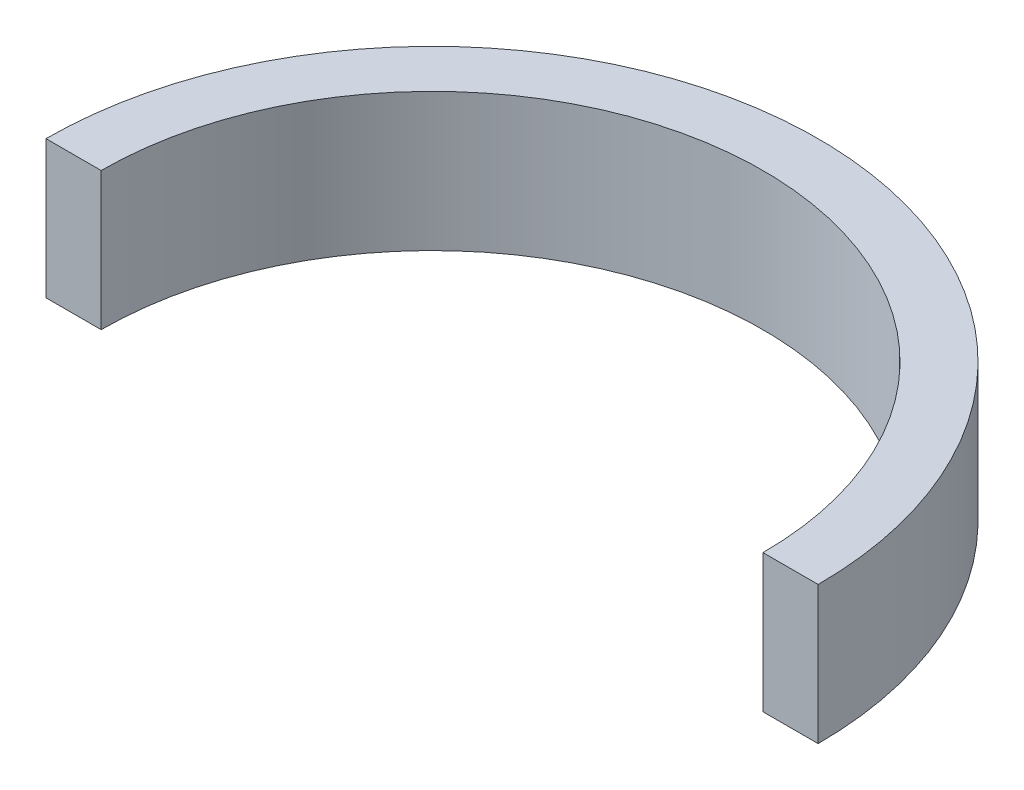
ISO-10303-21;
HEADER;
FILE_DESCRIPTION(('STEP AP214'),'2;1');
FILE_NAME('part.step','',(''),(''),'','','');
FILE_SCHEMA(('AUTOMOTIVE_DESIGN { 1 0 10303 214 1 1 1 1 }'));
ENDSEC;
DATA;
#1=APPLICATION_CONTEXT('core data for automotive mechanical design processes');
#2=APPLICATION_PROTOCOL_DEFINITION('international standard','automotive_design',2000,#1);
#3=PRODUCT_CONTEXT('',#1,'mechanical');
#4=PRODUCT('Part','Part','',(#3));
#5=PRODUCT_RELATED_PRODUCT_CATEGORY('part','',(#4));
#6=PRODUCT_DEFINITION_FORMATION('','',#4);
#7=PRODUCT_DEFINITION_CONTEXT('part definition',#1,'design');
#8=PRODUCT_DEFINITION('design','',#6,#7);
#9=PRODUCT_DEFINITION_SHAPE('','',#8);
#10=(LENGTH_UNIT() NAMED_UNIT(*) SI_UNIT(.MILLI.,.METRE.));
#11=(NAMED_UNIT(*) PLANE_ANGLE_UNIT() SI_UNIT($,.RADIAN.));
#12=(NAMED_UNIT(*) SI_UNIT($,.STERADIAN.) SOLID_ANGLE_UNIT());
#13=UNCERTAINTY_MEASURE_WITH_UNIT(LENGTH_MEASURE(1.E-05),#10,'distance_accuracy_value','');
#14=(GEOMETRIC_REPRESENTATION_CONTEXT(3) GLOBAL_UNCERTAINTY_ASSIGNED_CONTEXT((#13)) GLOBAL_UNIT_ASSIGNED_CONTEXT((#10,
#11,#12)) REPRESENTATION_CONTEXT('',''));
#15=CARTESIAN_POINT('',(0.,0.,0.));
#16=DIRECTION('',(0.,0.,1.));
#17=DIRECTION('',(1.,0.,0.));
#18=AXIS2_PLACEMENT_3D('',#15,#16,#17);
#19=CARTESIAN_POINT('',(0.,20.,0.));
#20=DIRECTION('',(0.,-1.,0.));
#21=DIRECTION('',(0.,0.,-1.));
#22=AXIS2_PLACEMENT_3D('',#19,#20,#21);
#23=CYLINDRICAL_SURFACE('',#22,56.);
#24=CARTESIAN_POINT('',(0.,0.,0.));
#25=DIRECTION('',(0.,1.,0.));
#26=DIRECTION('',(0.,0.,-1.));
#27=AXIS2_PLACEMENT_3D('',#24,#25,#26);
#28=CIRCLE('',#27,56.);
#29=CARTESIAN_POINT('',(56.,0.,0.));
#30=VERTEX_POINT('',#29);
#31=CARTESIAN_POINT('',(-56.,0.,0.));
#32=VERTEX_POINT('',#31);
#33=EDGE_CURVE('E97',#30,#32,#28,.T.);
#34=ORIENTED_EDGE('',*,*,#33,.T.);
#35=DIRECTION('',(0.,-1.,0.));
#36=VECTOR('',#35,1.);
#37=CARTESIAN_POINT('',(-56.,20.,0.));
#38=LINE('',#37,#36);
#39=CARTESIAN_POINT('',(-56.,20.,0.));
#40=VERTEX_POINT('',#39);
#41=EDGE_CURVE('E11',#40,#32,#38,.T.);
#42=ORIENTED_EDGE('',*,*,#41,.F.);
#43=CARTESIAN_POINT('',(0.,20.,0.));
#44=DIRECTION('',(0.,1.,0.));
#45=DIRECTION('',(0.,0.,-1.));
#46=AXIS2_PLACEMENT_3D('',#43,#44,#45);
#47=CIRCLE('',#46,56.);
#48=CARTESIAN_POINT('',(56.,20.,0.));
#49=VERTEX_POINT('',#48);
#50=EDGE_CURVE('E85',#49,#40,#47,.T.);
#51=ORIENTED_EDGE('',*,*,#50,.F.);
#52=DIRECTION('',(0.,-1.,0.));
#53=VECTOR('',#52,1.);
#54=CARTESIAN_POINT('',(56.,20.,0.));
#55=LINE('',#54,#53);
#56=EDGE_CURVE('E93',#49,#30,#55,.T.);
#57=ORIENTED_EDGE('',*,*,#56,.T.);
#58=EDGE_LOOP('',(#34,#42,#51,#57));
#59=FACE_BOUND('',#58,.T.);
#60=ADVANCED_FACE('F34',(#59),#23,.T.);
#61=CARTESIAN_POINT('',(-56.,20.,0.));
#62=DIRECTION('',(0.,0.,-1.));
#63=DIRECTION('',(-1.,0.,0.));
#64=AXIS2_PLACEMENT_3D('',#61,#62,#63);
#65=PLANE('',#64);
#66=DIRECTION('',(1.,0.,0.));
#67=VECTOR('',#66,1.);
#68=CARTESIAN_POINT('',(-56.,0.,0.));
#69=LINE('',#68,#67);
#70=CARTESIAN_POINT('',(-48.,0.,0.));
#71=VERTEX_POINT('',#70);
#72=EDGE_CURVE('E89',#32,#71,#69,.T.);
#73=ORIENTED_EDGE('',*,*,#72,.T.);
#74=DIRECTION('',(0.,-1.,0.));
#75=VECTOR('',#74,1.);
#76=CARTESIAN_POINT('',(-48.,20.,0.));
#77=LINE('',#76,#75);
#78=CARTESIAN_POINT('',(-48.,20.,0.));
#79=VERTEX_POINT('',#78);
#80=EDGE_CURVE('E42',#79,#71,#77,.T.);
#81=ORIENTED_EDGE('',*,*,#80,.F.);
#82=DIRECTION('',(1.,0.,0.));
#83=VECTOR('',#82,1.);
#84=CARTESIAN_POINT('',(-56.,20.,0.));
#85=LINE('',#84,#83);
#86=EDGE_CURVE('E80',#40,#79,#85,.T.);
#87=ORIENTED_EDGE('',*,*,#86,.F.);
#88=ORIENTED_EDGE('',*,*,#41,.T.);
#89=EDGE_LOOP('',(#73,#81,#87,#88));
#90=FACE_BOUND('',#89,.T.);
#91=ADVANCED_FACE('F88',(#90),#65,.F.);
#92=CARTESIAN_POINT('',(0.,20.,0.));
#93=DIRECTION('',(0.,-1.,0.));
#94=DIRECTION('',(0.,0.,-1.));
#95=AXIS2_PLACEMENT_3D('',#92,#93,#94);
#96=CYLINDRICAL_SURFACE('',#95,48.);
#97=CARTESIAN_POINT('',(0.,0.,0.));
#98=DIRECTION('',(0.,-1.,0.));
#99=DIRECTION('',(0.,0.,-1.));
#100=AXIS2_PLACEMENT_3D('',#97,#98,#99);
#101=CIRCLE('',#100,48.);
#102=CARTESIAN_POINT('',(48.,0.,0.));
#103=VERTEX_POINT('',#102);
#104=EDGE_CURVE('E67',#71,#103,#101,.T.);
#105=ORIENTED_EDGE('',*,*,#104,.T.);
#106=DIRECTION('',(0.,-1.,0.));
#107=VECTOR('',#106,1.);
#108=CARTESIAN_POINT('',(48.,20.,0.));
#109=LINE('',#108,#107);
#110=CARTESIAN_POINT('',(48.,20.,0.));
#111=VERTEX_POINT('',#110);
#112=EDGE_CURVE('E90',#111,#103,#109,.T.);
#113=ORIENTED_EDGE('',*,*,#112,.F.);
#114=CARTESIAN_POINT('',(0.,20.,0.));
#115=DIRECTION('',(0.,-1.,0.));
#116=DIRECTION('',(0.,0.,-1.));
#117=AXIS2_PLACEMENT_3D('',#114,#115,#116);
#118=CIRCLE('',#117,48.);
#119=EDGE_CURVE('E83',#79,#111,#118,.T.);
#120=ORIENTED_EDGE('',*,*,#119,.F.);
#121=ORIENTED_EDGE('',*,*,#80,.T.);
#122=EDGE_LOOP('',(#105,#113,#120,#121));
#123=FACE_BOUND('',#122,.T.);
#124=ADVANCED_FACE('F91',(#123),#96,.F.);
#125=CARTESIAN_POINT('',(48.,20.,0.));
#126=DIRECTION('',(0.,0.,-1.));
#127=DIRECTION('',(-1.,0.,0.));
#128=AXIS2_PLACEMENT_3D('',#125,#126,#127);
#129=PLANE('',#128);
#130=DIRECTION('',(1.,0.,0.));
#131=VECTOR('',#130,1.);
#132=CARTESIAN_POINT('',(48.,0.,0.));
#133=LINE('',#132,#131);
#134=EDGE_CURVE('E73',#103,#30,#133,.T.);
#135=ORIENTED_EDGE('',*,*,#134,.T.);
#136=ORIENTED_EDGE('',*,*,#56,.F.);
#137=DIRECTION('',(1.,0.,0.));
#138=VECTOR('',#137,1.);
#139=CARTESIAN_POINT('',(48.,20.,0.));
#140=LINE('',#139,#138);
#141=EDGE_CURVE('E50',#111,#49,#140,.T.);
#142=ORIENTED_EDGE('',*,*,#141,.F.);
#143=ORIENTED_EDGE('',*,*,#112,.T.);
#144=EDGE_LOOP('',(#135,#136,#142,#143));
#145=FACE_BOUND('',#144,.T.);
#146=ADVANCED_FACE('F104',(#145),#129,.F.);
#147=CARTESIAN_POINT('',(0.,20.,0.));
#148=DIRECTION('',(0.,-1.,0.));
#149=DIRECTION('',(0.,0.,-1.));
#150=AXIS2_PLACEMENT_3D('',#147,#148,#149);
#151=PLANE('',#150);
#152=ORIENTED_EDGE('',*,*,#50,.T.);
#153=ORIENTED_EDGE('',*,*,#86,.T.);
#154=ORIENTED_EDGE('',*,*,#119,.T.);
#155=ORIENTED_EDGE('',*,*,#141,.T.);
#156=EDGE_LOOP('',(#152,#153,#154,#155));
#157=FACE_BOUND('',#156,.T.);
#158=ADVANCED_FACE('F81',(#157),#151,.F.);
#159=CARTESIAN_POINT('',(0.,0.,0.));
#160=DIRECTION('',(0.,-1.,0.));
#161=DIRECTION('',(0.,0.,-1.));
#162=AXIS2_PLACEMENT_3D('',#159,#160,#161);
#163=PLANE('',#162);
#164=ORIENTED_EDGE('',*,*,#33,.F.);
#165=ORIENTED_EDGE('',*,*,#134,.F.);
#166=ORIENTED_EDGE('',*,*,#104,.F.);
#167=ORIENTED_EDGE('',*,*,#72,.F.);
#168=EDGE_LOOP('',(#164,#165,#166,#167));
#169=FACE_BOUND('',#168,.T.);
#170=ADVANCED_FACE('F107',(#169),#163,.T.);
#171=CLOSED_SHELL('',(#60,#91,#124,#146,#158,#170));
#172=MANIFOLD_SOLID_BREP('B2',#171);
#173=ADVANCED_BREP_SHAPE_REPRESENTATION('',(#18,#172),#14);
#174=SHAPE_DEFINITION_REPRESENTATION(#9,#173);
ENDSEC;
END-ISO-10303-21;
